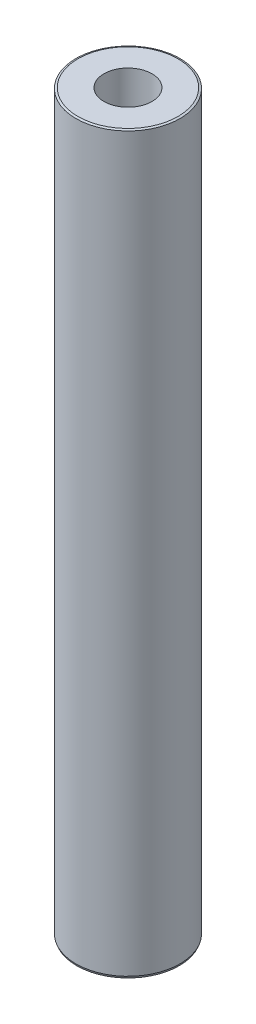
ISO-10303-21;
HEADER;
FILE_DESCRIPTION(('STEP AP214'),'2;1');
FILE_NAME('part.step','',(''),(''),'','','');
FILE_SCHEMA(('AUTOMOTIVE_DESIGN { 1 0 10303 214 1 1 1 1 }'));
ENDSEC;
DATA;
#1=APPLICATION_CONTEXT('core data for automotive mechanical design processes');
#2=APPLICATION_PROTOCOL_DEFINITION('international standard','automotive_design',2000,#1);
#3=PRODUCT_CONTEXT('',#1,'mechanical');
#4=PRODUCT('Part','Part','',(#3));
#5=PRODUCT_RELATED_PRODUCT_CATEGORY('part','',(#4));
#6=PRODUCT_DEFINITION_FORMATION('','',#4);
#7=PRODUCT_DEFINITION_CONTEXT('part definition',#1,'design');
#8=PRODUCT_DEFINITION('design','',#6,#7);
#9=PRODUCT_DEFINITION_SHAPE('','',#8);
#10=(LENGTH_UNIT() NAMED_UNIT(*) SI_UNIT(.MILLI.,.METRE.));
#11=(NAMED_UNIT(*) PLANE_ANGLE_UNIT() SI_UNIT($,.RADIAN.));
#12=(NAMED_UNIT(*) SI_UNIT($,.STERADIAN.) SOLID_ANGLE_UNIT());
#13=UNCERTAINTY_MEASURE_WITH_UNIT(LENGTH_MEASURE(1.E-05),#10,'distance_accuracy_value','');
#14=(GEOMETRIC_REPRESENTATION_CONTEXT(3) GLOBAL_UNCERTAINTY_ASSIGNED_CONTEXT((#13)) GLOBAL_UNIT_ASSIGNED_CONTEXT((#10,
#11,#12)) REPRESENTATION_CONTEXT('',''));
#15=CARTESIAN_POINT('',(0.,0.,0.));
#16=DIRECTION('',(0.,0.,1.));
#17=DIRECTION('',(1.,0.,0.));
#18=AXIS2_PLACEMENT_3D('',#15,#16,#17);
#19=CARTESIAN_POINT('',(0.,600.,0.));
#20=DIRECTION('',(0.,-1.,0.));
#21=DIRECTION('',(0.,0.,-1.));
#22=AXIS2_PLACEMENT_3D('',#19,#20,#21);
#23=CYLINDRICAL_SURFACE('',#22,42.5);
#24=CARTESIAN_POINT('',(0.,599.386840735592,0.));
#25=DIRECTION('',(0.,1.,0.));
#26=DIRECTION('',(0.,0.,1.));
#27=AXIS2_PLACEMENT_3D('',#24,#25,#26);
#28=CIRCLE('',#27,42.5);
#29=CARTESIAN_POINT('',(0.,599.386840735592,42.5));
#30=VERTEX_POINT('',#29);
#31=EDGE_CURVE('E50',#30,#30,#28,.F.);
#32=ORIENTED_EDGE('',*,*,#31,.T.);
#33=EDGE_LOOP('',(#32));
#34=FACE_BOUND('',#33,.T.);
#35=CARTESIAN_POINT('',(0.,1.65081858358995,0.));
#36=DIRECTION('',(0.,1.,0.));
#37=DIRECTION('',(0.,0.,1.));
#38=AXIS2_PLACEMENT_3D('',#35,#36,#37);
#39=CIRCLE('',#38,42.5);
#40=CARTESIAN_POINT('',(0.,1.65081858358995,42.5));
#41=VERTEX_POINT('',#40);
#42=EDGE_CURVE('E51',#41,#41,#39,.T.);
#43=ORIENTED_EDGE('',*,*,#42,.T.);
#44=EDGE_LOOP('',(#43));
#45=FACE_BOUND('',#44,.T.);
#46=ADVANCED_FACE('F39',(#34,#45),#23,.T.);
#47=CARTESIAN_POINT('',(0.,600.,0.));
#48=DIRECTION('',(0.,1.,0.));
#49=DIRECTION('',(0.,0.,1.));
#50=AXIS2_PLACEMENT_3D('',#47,#48,#49);
#51=PLANE('',#50);
#52=CARTESIAN_POINT('',(0.,600.,0.));
#53=DIRECTION('',(0.,1.,0.));
#54=DIRECTION('',(0.,0.,1.));
#55=AXIS2_PLACEMENT_3D('',#52,#53,#54);
#56=CIRCLE('',#55,40.8491814164093);
#57=CARTESIAN_POINT('',(0.,600.,40.8491814164093));
#58=VERTEX_POINT('',#57);
#59=EDGE_CURVE('E54',#58,#58,#56,.T.);
#60=ORIENTED_EDGE('',*,*,#59,.T.);
#61=EDGE_LOOP('',(#60));
#62=FACE_BOUND('',#61,.T.);
#63=CARTESIAN_POINT('',(0.,600.,0.));
#64=DIRECTION('',(0.,1.,0.));
#65=DIRECTION('',(0.,0.,1.));
#66=AXIS2_PLACEMENT_3D('',#63,#64,#65);
#67=CIRCLE('',#66,19.6298030575922);
#68=CARTESIAN_POINT('',(0.,600.,19.6298030575922));
#69=VERTEX_POINT('',#68);
#70=EDGE_CURVE('E58',#69,#69,#67,.T.);
#71=ORIENTED_EDGE('',*,*,#70,.F.);
#72=EDGE_LOOP('',(#71));
#73=FACE_BOUND('',#72,.T.);
#74=ADVANCED_FACE('F69',(#62,#73),#51,.T.);
#75=CARTESIAN_POINT('',(0.,0.,0.));
#76=DIRECTION('',(0.,1.,0.));
#77=DIRECTION('',(0.,0.,1.));
#78=AXIS2_PLACEMENT_3D('',#75,#76,#77);
#79=PLANE('',#78);
#80=CARTESIAN_POINT('',(0.,0.,0.));
#81=DIRECTION('',(0.,1.,0.));
#82=DIRECTION('',(0.,0.,1.));
#83=AXIS2_PLACEMENT_3D('',#80,#81,#82);
#84=CIRCLE('',#83,41.8868407355924);
#85=CARTESIAN_POINT('',(0.,0.,41.8868407355924));
#86=VERTEX_POINT('',#85);
#87=EDGE_CURVE('E10',#86,#86,#84,.F.);
#88=ORIENTED_EDGE('',*,*,#87,.T.);
#89=EDGE_LOOP('',(#88));
#90=FACE_BOUND('',#89,.T.);
#91=CARTESIAN_POINT('',(0.,0.,0.));
#92=DIRECTION('',(0.,1.,0.));
#93=DIRECTION('',(0.,0.,1.));
#94=AXIS2_PLACEMENT_3D('',#91,#92,#93);
#95=CIRCLE('',#94,19.6298030575922);
#96=CARTESIAN_POINT('',(0.,0.,19.6298030575922));
#97=VERTEX_POINT('',#96);
#98=EDGE_CURVE('E63',#97,#97,#95,.T.);
#99=ORIENTED_EDGE('',*,*,#98,.T.);
#100=EDGE_LOOP('',(#99));
#101=FACE_BOUND('',#100,.T.);
#102=ADVANCED_FACE('F75',(#90,#101),#79,.F.);
#103=CARTESIAN_POINT('',(0.,600.,0.));
#104=DIRECTION('',(0.,-1.,0.));
#105=DIRECTION('',(0.,0.,-1.));
#106=AXIS2_PLACEMENT_3D('',#103,#104,#105);
#107=CYLINDRICAL_SURFACE('',#106,19.6298030575922);
#108=ORIENTED_EDGE('',*,*,#70,.T.);
#109=EDGE_LOOP('',(#108));
#110=FACE_BOUND('',#109,.T.);
#111=ORIENTED_EDGE('',*,*,#98,.F.);
#112=EDGE_LOOP('',(#111));
#113=FACE_BOUND('',#112,.T.);
#114=ADVANCED_FACE('F70',(#110,#113),#107,.F.);
#115=CARTESIAN_POINT('',(0.,600.,0.));
#116=DIRECTION('',(0.,-1.,0.));
#117=DIRECTION('',(0.,0.,-1.));
#118=AXIS2_PLACEMENT_3D('',#115,#116,#117);
#119=CONICAL_SURFACE('',#118,40.8491814164093,1.21516146656548);
#120=ORIENTED_EDGE('',*,*,#31,.F.);
#121=EDGE_LOOP('',(#120));
#122=FACE_BOUND('',#121,.T.);
#123=ORIENTED_EDGE('',*,*,#59,.F.);
#124=EDGE_LOOP('',(#123));
#125=FACE_BOUND('',#124,.T.);
#126=ADVANCED_FACE('F81',(#122,#125),#119,.T.);
#127=CARTESIAN_POINT('',(0.,1.65081858358995,0.));
#128=DIRECTION('',(0.,1.,0.));
#129=DIRECTION('',(0.,0.,1.));
#130=AXIS2_PLACEMENT_3D('',#127,#128,#129);
#131=CONICAL_SURFACE('',#130,42.5,0.355634860229445);
#132=ORIENTED_EDGE('',*,*,#87,.F.);
#133=EDGE_LOOP('',(#132));
#134=FACE_BOUND('',#133,.T.);
#135=ORIENTED_EDGE('',*,*,#42,.F.);
#136=EDGE_LOOP('',(#135));
#137=FACE_BOUND('',#136,.T.);
#138=ADVANCED_FACE('F45',(#134,#137),#131,.T.);
#139=CLOSED_SHELL('',(#46,#74,#102,#114,#126,#138));
#140=MANIFOLD_SOLID_BREP('B2',#139);
#141=ADVANCED_BREP_SHAPE_REPRESENTATION('',(#18,#140),#14);
#142=SHAPE_DEFINITION_REPRESENTATION(#9,#141);
ENDSEC;
END-ISO-10303-21;
